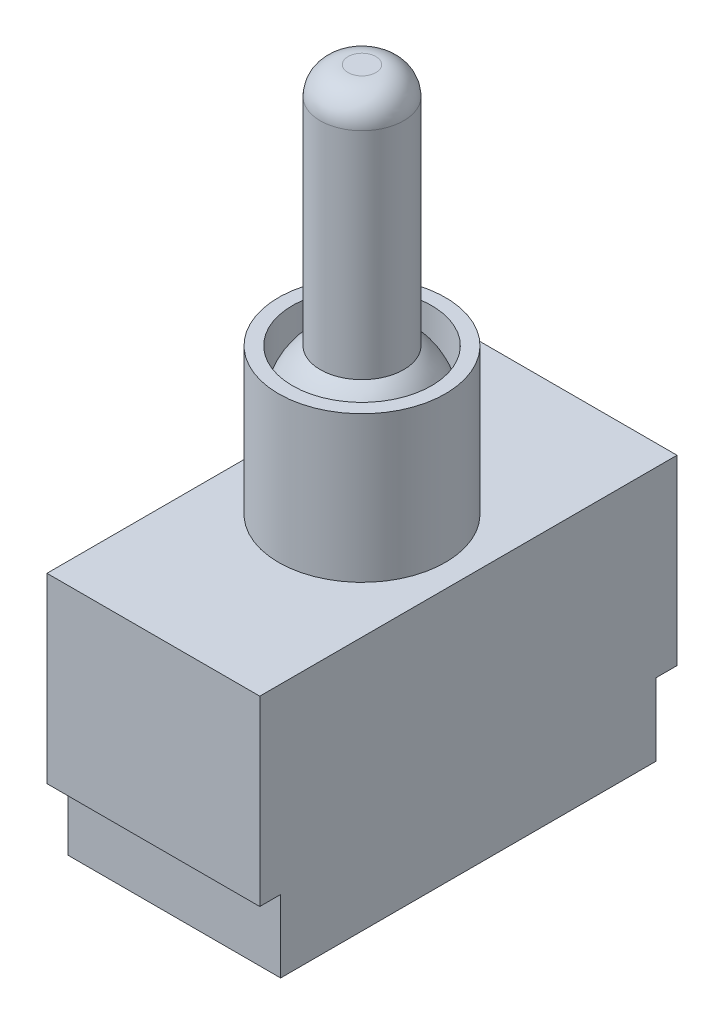
ISO-10303-21;
HEADER;
FILE_DESCRIPTION(('STEP AP214'),'2;1');
FILE_NAME('part.step','',(''),(''),'','','');
FILE_SCHEMA(('AUTOMOTIVE_DESIGN { 1 0 10303 214 1 1 1 1 }'));
ENDSEC;
DATA;
#1=APPLICATION_CONTEXT('core data for automotive mechanical design processes');
#2=APPLICATION_PROTOCOL_DEFINITION('international standard','automotive_design',2000,#1);
#3=PRODUCT_CONTEXT('',#1,'mechanical');
#4=PRODUCT('Part','Part','',(#3));
#5=PRODUCT_RELATED_PRODUCT_CATEGORY('part','',(#4));
#6=PRODUCT_DEFINITION_FORMATION('','',#4);
#7=PRODUCT_DEFINITION_CONTEXT('part definition',#1,'design');
#8=PRODUCT_DEFINITION('design','',#6,#7);
#9=PRODUCT_DEFINITION_SHAPE('','',#8);
#10=(LENGTH_UNIT() NAMED_UNIT(*) SI_UNIT(.MILLI.,.METRE.));
#11=(NAMED_UNIT(*) PLANE_ANGLE_UNIT() SI_UNIT($,.RADIAN.));
#12=(NAMED_UNIT(*) SI_UNIT($,.STERADIAN.) SOLID_ANGLE_UNIT());
#13=UNCERTAINTY_MEASURE_WITH_UNIT(LENGTH_MEASURE(1.E-05),#10,'distance_accuracy_value','');
#14=(GEOMETRIC_REPRESENTATION_CONTEXT(3) GLOBAL_UNCERTAINTY_ASSIGNED_CONTEXT((#13)) GLOBAL_UNIT_ASSIGNED_CONTEXT((#10,
#11,#12)) REPRESENTATION_CONTEXT('',''));
#15=CARTESIAN_POINT('',(0.,0.,0.));
#16=DIRECTION('',(0.,0.,1.));
#17=DIRECTION('',(1.,0.,0.));
#18=AXIS2_PLACEMENT_3D('',#15,#16,#17);
#19=CARTESIAN_POINT('',(0.,0.,0.));
#20=DIRECTION('',(0.,1.,0.));
#21=DIRECTION('',(0.,0.,1.));
#22=AXIS2_PLACEMENT_3D('',#19,#20,#21);
#23=PLANE('',#22);
#24=DIRECTION('',(-1.,0.,0.));
#25=VECTOR('',#24,1.);
#26=CARTESIAN_POINT('',(7.65,0.,13.5));
#27=LINE('',#26,#25);
#28=CARTESIAN_POINT('',(7.65,0.,13.5));
#29=VERTEX_POINT('',#28);
#30=CARTESIAN_POINT('',(-7.65,0.,13.5));
#31=VERTEX_POINT('',#30);
#32=EDGE_CURVE('E50',#29,#31,#27,.T.);
#33=ORIENTED_EDGE('',*,*,#32,.F.);
#34=DIRECTION('',(0.,0.,-1.));
#35=VECTOR('',#34,1.);
#36=CARTESIAN_POINT('',(7.65,0.,15.));
#37=LINE('',#36,#35);
#38=CARTESIAN_POINT('',(7.65,0.,15.));
#39=VERTEX_POINT('',#38);
#40=EDGE_CURVE('E157',#39,#29,#37,.T.);
#41=ORIENTED_EDGE('',*,*,#40,.F.);
#42=DIRECTION('',(1.,0.,0.));
#43=VECTOR('',#42,1.);
#44=CARTESIAN_POINT('',(7.65,0.,15.));
#45=LINE('',#44,#43);
#46=CARTESIAN_POINT('',(-7.65,0.,15.));
#47=VERTEX_POINT('',#46);
#48=EDGE_CURVE('E154',#47,#39,#45,.T.);
#49=ORIENTED_EDGE('',*,*,#48,.F.);
#50=DIRECTION('',(0.,0.,1.));
#51=VECTOR('',#50,1.);
#52=CARTESIAN_POINT('',(-7.65,0.,15.));
#53=LINE('',#52,#51);
#54=EDGE_CURVE('E55',#31,#47,#53,.T.);
#55=ORIENTED_EDGE('',*,*,#54,.F.);
#56=EDGE_LOOP('',(#33,#41,#49,#55));
#57=FACE_BOUND('',#56,.T.);
#58=ADVANCED_FACE('F35',(#57),#23,.F.);
#59=DIRECTION('',(1.,0.,0.));
#60=VECTOR('',#59,1.);
#61=CARTESIAN_POINT('',(7.65,0.,-13.5));
#62=LINE('',#61,#60);
#63=CARTESIAN_POINT('',(-7.65,0.,-13.5));
#64=VERTEX_POINT('',#63);
#65=CARTESIAN_POINT('',(7.65,0.,-13.5));
#66=VERTEX_POINT('',#65);
#67=EDGE_CURVE('E327',#64,#66,#62,.T.);
#68=ORIENTED_EDGE('',*,*,#67,.F.);
#69=CARTESIAN_POINT('',(-7.65,0.,-15.));
#70=VERTEX_POINT('',#69);
#71=EDGE_CURVE('E124',#70,#64,#53,.T.);
#72=ORIENTED_EDGE('',*,*,#71,.F.);
#73=DIRECTION('',(-1.,0.,0.));
#74=VECTOR('',#73,1.);
#75=CARTESIAN_POINT('',(7.65,0.,-15.));
#76=LINE('',#75,#74);
#77=CARTESIAN_POINT('',(7.65,0.,-15.));
#78=VERTEX_POINT('',#77);
#79=EDGE_CURVE('E146',#78,#70,#76,.T.);
#80=ORIENTED_EDGE('',*,*,#79,.F.);
#81=EDGE_CURVE('E156',#66,#78,#37,.T.);
#82=ORIENTED_EDGE('',*,*,#81,.F.);
#83=EDGE_LOOP('',(#68,#72,#80,#82));
#84=FACE_BOUND('',#83,.T.);
#85=ADVANCED_FACE('F190',(#84),#23,.F.);
#86=CARTESIAN_POINT('',(-7.65,13.1,15.));
#87=DIRECTION('',(1.,0.,0.));
#88=DIRECTION('',(0.,0.,-1.));
#89=AXIS2_PLACEMENT_3D('',#86,#87,#88);
#90=PLANE('',#89);
#91=ORIENTED_EDGE('',*,*,#71,.T.);
#92=DIRECTION('',(0.,1.,0.));
#93=VECTOR('',#92,1.);
#94=CARTESIAN_POINT('',(-7.65,-5.2,-13.5));
#95=LINE('',#94,#93);
#96=CARTESIAN_POINT('',(-7.65,-5.2,-13.5));
#97=VERTEX_POINT('',#96);
#98=EDGE_CURVE('E104',#97,#64,#95,.T.);
#99=ORIENTED_EDGE('',*,*,#98,.F.);
#100=DIRECTION('',(0.,0.,-1.));
#101=VECTOR('',#100,1.);
#102=CARTESIAN_POINT('',(-7.65,-5.2,13.5));
#103=LINE('',#102,#101);
#104=CARTESIAN_POINT('',(-7.65,-5.2,13.5));
#105=VERTEX_POINT('',#104);
#106=EDGE_CURVE('E110',#105,#97,#103,.T.);
#107=ORIENTED_EDGE('',*,*,#106,.F.);
#108=DIRECTION('',(0.,1.,0.));
#109=VECTOR('',#108,1.);
#110=CARTESIAN_POINT('',(-7.65,-5.2,13.5));
#111=LINE('',#110,#109);
#112=EDGE_CURVE('E325',#105,#31,#111,.T.);
#113=ORIENTED_EDGE('',*,*,#112,.T.);
#114=ORIENTED_EDGE('',*,*,#54,.T.);
#115=DIRECTION('',(0.,-1.,0.));
#116=VECTOR('',#115,1.);
#117=CARTESIAN_POINT('',(-7.65,13.1,15.));
#118=LINE('',#117,#116);
#119=CARTESIAN_POINT('',(-7.65,13.1,15.));
#120=VERTEX_POINT('',#119);
#121=EDGE_CURVE('E167',#120,#47,#118,.T.);
#122=ORIENTED_EDGE('',*,*,#121,.F.);
#123=DIRECTION('',(0.,0.,1.));
#124=VECTOR('',#123,1.);
#125=CARTESIAN_POINT('',(-7.65,13.1,15.));
#126=LINE('',#125,#124);
#127=CARTESIAN_POINT('',(-7.65,13.1,-15.));
#128=VERTEX_POINT('',#127);
#129=EDGE_CURVE('E142',#128,#120,#126,.T.);
#130=ORIENTED_EDGE('',*,*,#129,.F.);
#131=DIRECTION('',(0.,-1.,0.));
#132=VECTOR('',#131,1.);
#133=CARTESIAN_POINT('',(-7.65,13.1,-15.));
#134=LINE('',#133,#132);
#135=EDGE_CURVE('E152',#128,#70,#134,.T.);
#136=ORIENTED_EDGE('',*,*,#135,.T.);
#137=EDGE_LOOP('',(#91,#99,#107,#113,#114,#122,#130,#136));
#138=FACE_BOUND('',#137,.T.);
#139=ADVANCED_FACE('F121',(#138),#90,.F.);
#140=CARTESIAN_POINT('',(7.65,13.1,15.));
#141=DIRECTION('',(0.,0.,-1.));
#142=DIRECTION('',(-1.,0.,0.));
#143=AXIS2_PLACEMENT_3D('',#140,#141,#142);
#144=PLANE('',#143);
#145=ORIENTED_EDGE('',*,*,#48,.T.);
#146=DIRECTION('',(0.,-1.,0.));
#147=VECTOR('',#146,1.);
#148=CARTESIAN_POINT('',(7.65,13.1,15.));
#149=LINE('',#148,#147);
#150=CARTESIAN_POINT('',(7.65,13.1,15.));
#151=VERTEX_POINT('',#150);
#152=EDGE_CURVE('E164',#151,#39,#149,.T.);
#153=ORIENTED_EDGE('',*,*,#152,.F.);
#154=DIRECTION('',(1.,0.,0.));
#155=VECTOR('',#154,1.);
#156=CARTESIAN_POINT('',(7.65,13.1,15.));
#157=LINE('',#156,#155);
#158=EDGE_CURVE('E145',#120,#151,#157,.T.);
#159=ORIENTED_EDGE('',*,*,#158,.F.);
#160=ORIENTED_EDGE('',*,*,#121,.T.);
#161=EDGE_LOOP('',(#145,#153,#159,#160));
#162=FACE_BOUND('',#161,.T.);
#163=ADVANCED_FACE('F207',(#162),#144,.F.);
#164=CARTESIAN_POINT('',(7.65,13.1,15.));
#165=DIRECTION('',(-1.,0.,0.));
#166=DIRECTION('',(0.,0.,1.));
#167=AXIS2_PLACEMENT_3D('',#164,#165,#166);
#168=PLANE('',#167);
#169=ORIENTED_EDGE('',*,*,#40,.T.);
#170=DIRECTION('',(0.,1.,0.));
#171=VECTOR('',#170,1.);
#172=CARTESIAN_POINT('',(7.65,-5.2,13.5));
#173=LINE('',#172,#171);
#174=CARTESIAN_POINT('',(7.65,-5.2,13.5));
#175=VERTEX_POINT('',#174);
#176=EDGE_CURVE('E130',#175,#29,#173,.T.);
#177=ORIENTED_EDGE('',*,*,#176,.F.);
#178=DIRECTION('',(0.,0.,1.));
#179=VECTOR('',#178,1.);
#180=CARTESIAN_POINT('',(7.65,-5.2,13.5));
#181=LINE('',#180,#179);
#182=CARTESIAN_POINT('',(7.65,-5.2,-13.5));
#183=VERTEX_POINT('',#182);
#184=EDGE_CURVE('E109',#183,#175,#181,.T.);
#185=ORIENTED_EDGE('',*,*,#184,.F.);
#186=DIRECTION('',(0.,1.,0.));
#187=VECTOR('',#186,1.);
#188=CARTESIAN_POINT('',(7.65,-5.2,-13.5));
#189=LINE('',#188,#187);
#190=EDGE_CURVE('E106',#183,#66,#189,.T.);
#191=ORIENTED_EDGE('',*,*,#190,.T.);
#192=ORIENTED_EDGE('',*,*,#81,.T.);
#193=DIRECTION('',(0.,-1.,0.));
#194=VECTOR('',#193,1.);
#195=CARTESIAN_POINT('',(7.65,13.1,-15.));
#196=LINE('',#195,#194);
#197=CARTESIAN_POINT('',(7.65,13.1,-15.));
#198=VERTEX_POINT('',#197);
#199=EDGE_CURVE('E161',#198,#78,#196,.T.);
#200=ORIENTED_EDGE('',*,*,#199,.F.);
#201=DIRECTION('',(0.,0.,-1.));
#202=VECTOR('',#201,1.);
#203=CARTESIAN_POINT('',(7.65,13.1,15.));
#204=LINE('',#203,#202);
#205=EDGE_CURVE('E148',#151,#198,#204,.T.);
#206=ORIENTED_EDGE('',*,*,#205,.F.);
#207=ORIENTED_EDGE('',*,*,#152,.T.);
#208=EDGE_LOOP('',(#169,#177,#185,#191,#192,#200,#206,#207));
#209=FACE_BOUND('',#208,.T.);
#210=ADVANCED_FACE('F203',(#209),#168,.F.);
#211=CARTESIAN_POINT('',(7.65,13.1,-15.));
#212=DIRECTION('',(0.,0.,1.));
#213=DIRECTION('',(1.,0.,0.));
#214=AXIS2_PLACEMENT_3D('',#211,#212,#213);
#215=PLANE('',#214);
#216=ORIENTED_EDGE('',*,*,#79,.T.);
#217=ORIENTED_EDGE('',*,*,#135,.F.);
#218=DIRECTION('',(-1.,0.,0.));
#219=VECTOR('',#218,1.);
#220=CARTESIAN_POINT('',(7.65,13.1,-15.));
#221=LINE('',#220,#219);
#222=EDGE_CURVE('E150',#198,#128,#221,.T.);
#223=ORIENTED_EDGE('',*,*,#222,.F.);
#224=ORIENTED_EDGE('',*,*,#199,.T.);
#225=EDGE_LOOP('',(#216,#217,#223,#224));
#226=FACE_BOUND('',#225,.T.);
#227=ADVANCED_FACE('F200',(#226),#215,.F.);
#228=CARTESIAN_POINT('',(0.,13.1,0.));
#229=DIRECTION('',(0.,1.,0.));
#230=DIRECTION('',(0.,0.,1.));
#231=AXIS2_PLACEMENT_3D('',#228,#229,#230);
#232=PLANE('',#231);
#233=CARTESIAN_POINT('',(0.,13.1,0.));
#234=DIRECTION('',(0.,1.,0.));
#235=DIRECTION('',(0.,0.,1.));
#236=AXIS2_PLACEMENT_3D('',#233,#234,#235);
#237=CIRCLE('',#236,6.);
#238=CARTESIAN_POINT('',(0.,13.1,6.));
#239=VERTEX_POINT('',#238);
#240=EDGE_CURVE('E135',#239,#239,#237,.T.);
#241=ORIENTED_EDGE('',*,*,#240,.F.);
#242=EDGE_LOOP('',(#241));
#243=FACE_BOUND('',#242,.T.);
#244=ORIENTED_EDGE('',*,*,#129,.T.);
#245=ORIENTED_EDGE('',*,*,#158,.T.);
#246=ORIENTED_EDGE('',*,*,#205,.T.);
#247=ORIENTED_EDGE('',*,*,#222,.T.);
#248=EDGE_LOOP('',(#244,#245,#246,#247));
#249=FACE_BOUND('',#248,.T.);
#250=ADVANCED_FACE('F198',(#243,#249),#232,.T.);
#251=CARTESIAN_POINT('',(0.,23.6,0.));
#252=DIRECTION('',(0.,-1.,0.));
#253=DIRECTION('',(0.,0.,-1.));
#254=AXIS2_PLACEMENT_3D('',#251,#252,#253);
#255=CYLINDRICAL_SURFACE('',#254,6.);
#256=CARTESIAN_POINT('',(0.,23.6,0.));
#257=DIRECTION('',(0.,1.,0.));
#258=DIRECTION('',(0.,0.,1.));
#259=AXIS2_PLACEMENT_3D('',#256,#257,#258);
#260=CIRCLE('',#259,6.);
#261=CARTESIAN_POINT('',(0.,23.6,6.));
#262=VERTEX_POINT('',#261);
#263=EDGE_CURVE('E137',#262,#262,#260,.T.);
#264=ORIENTED_EDGE('',*,*,#263,.F.);
#265=EDGE_LOOP('',(#264));
#266=FACE_BOUND('',#265,.T.);
#267=ORIENTED_EDGE('',*,*,#240,.T.);
#268=EDGE_LOOP('',(#267));
#269=FACE_BOUND('',#268,.T.);
#270=ADVANCED_FACE('F235',(#266,#269),#255,.T.);
#271=CARTESIAN_POINT('',(0.,23.6,0.));
#272=DIRECTION('',(0.,1.,0.));
#273=DIRECTION('',(0.,0.,1.));
#274=AXIS2_PLACEMENT_3D('',#271,#272,#273);
#275=PLANE('',#274);
#276=CARTESIAN_POINT('',(0.,23.6,0.));
#277=DIRECTION('',(0.,1.,0.));
#278=DIRECTION('',(0.,0.,1.));
#279=AXIS2_PLACEMENT_3D('',#276,#277,#278);
#280=CIRCLE('',#279,5.);
#281=CARTESIAN_POINT('',(0.,23.6,5.));
#282=VERTEX_POINT('',#281);
#283=EDGE_CURVE('E125',#282,#282,#280,.T.);
#284=ORIENTED_EDGE('',*,*,#283,.F.);
#285=EDGE_LOOP('',(#284));
#286=FACE_BOUND('',#285,.T.);
#287=ORIENTED_EDGE('',*,*,#263,.T.);
#288=EDGE_LOOP('',(#287));
#289=FACE_BOUND('',#288,.T.);
#290=ADVANCED_FACE('F242',(#286,#289),#275,.T.);
#291=CARTESIAN_POINT('',(0.,19.6,0.));
#292=DIRECTION('',(0.,1.,0.));
#293=DIRECTION('',(0.,0.,1.));
#294=AXIS2_PLACEMENT_3D('',#291,#292,#293);
#295=CYLINDRICAL_SURFACE('',#294,5.);
#296=CARTESIAN_POINT('',(0.,19.6,0.));
#297=DIRECTION('',(0.,1.,0.));
#298=DIRECTION('',(0.,0.,1.));
#299=AXIS2_PLACEMENT_3D('',#296,#297,#298);
#300=CIRCLE('',#299,5.);
#301=CARTESIAN_POINT('',(0.,19.6,5.));
#302=VERTEX_POINT('',#301);
#303=EDGE_CURVE('E128',#302,#302,#300,.T.);
#304=ORIENTED_EDGE('',*,*,#303,.F.);
#305=EDGE_LOOP('',(#304));
#306=FACE_BOUND('',#305,.T.);
#307=ORIENTED_EDGE('',*,*,#283,.T.);
#308=EDGE_LOOP('',(#307));
#309=FACE_BOUND('',#308,.T.);
#310=ADVANCED_FACE('F249',(#306,#309),#295,.F.);
#311=CARTESIAN_POINT('',(0.,19.6,0.));
#312=DIRECTION('',(0.,0.,1.));
#313=DIRECTION('',(1.,0.,0.));
#314=AXIS2_PLACEMENT_3D('',#311,#312,#313);
#315=SPHERICAL_SURFACE('',#314,5.);
#316=CARTESIAN_POINT('',(0.,19.6,0.));
#317=DIRECTION('',(0.,1.,0.));
#318=DIRECTION('',(0.,0.,1.));
#319=AXIS2_PLACEMENT_3D('',#316,#317,#318);
#320=SPHERICAL_SURFACE('',#319,5.);
#321=ORIENTED_EDGE('',*,*,#303,.T.);
#322=EDGE_LOOP('',(#321));
#323=FACE_BOUND('',#322,.T.);
#324=CARTESIAN_POINT('',(0.,23.6,0.));
#325=DIRECTION('',(0.,-1.,0.));
#326=DIRECTION('',(0.,0.,-1.));
#327=AXIS2_PLACEMENT_3D('',#324,#325,#326);
#328=CIRCLE('',#327,3.);
#329=CARTESIAN_POINT('',(0.,23.6,-3.));
#330=VERTEX_POINT('',#329);
#331=EDGE_CURVE('E170',#330,#330,#328,.T.);
#332=ORIENTED_EDGE('',*,*,#331,.T.);
#333=EDGE_LOOP('',(#332));
#334=FACE_BOUND('',#333,.T.);
#335=ADVANCED_FACE('F257',(#323,#334),#320,.T.);
#336=CARTESIAN_POINT('',(0.,41.1,0.));
#337=DIRECTION('',(0.,1.,0.));
#338=DIRECTION('',(0.,0.,1.));
#339=AXIS2_PLACEMENT_3D('',#336,#337,#338);
#340=PLANE('',#339);
#341=CARTESIAN_POINT('',(0.,41.1,0.));
#342=DIRECTION('',(0.,1.,0.));
#343=DIRECTION('',(0.,0.,1.));
#344=AXIS2_PLACEMENT_3D('',#341,#342,#343);
#345=CIRCLE('',#344,1.);
#346=CARTESIAN_POINT('',(0.,41.1,1.));
#347=VERTEX_POINT('',#346);
#348=EDGE_CURVE('E43',#347,#347,#345,.T.);
#349=ORIENTED_EDGE('',*,*,#348,.T.);
#350=EDGE_LOOP('',(#349));
#351=FACE_BOUND('',#350,.T.);
#352=ADVANCED_FACE('F175',(#351),#340,.T.);
#353=CARTESIAN_POINT('',(0.,41.1,0.));
#354=DIRECTION('',(0.,-1.,0.));
#355=DIRECTION('',(0.,0.,-1.));
#356=AXIS2_PLACEMENT_3D('',#353,#354,#355);
#357=CYLINDRICAL_SURFACE('',#356,3.);
#358=CARTESIAN_POINT('',(0.,39.1,0.));
#359=DIRECTION('',(0.,1.,0.));
#360=DIRECTION('',(0.,0.,1.));
#361=AXIS2_PLACEMENT_3D('',#358,#359,#360);
#362=CIRCLE('',#361,3.);
#363=CARTESIAN_POINT('',(0.,39.1,3.));
#364=VERTEX_POINT('',#363);
#365=EDGE_CURVE('E11',#364,#364,#362,.F.);
#366=ORIENTED_EDGE('',*,*,#365,.T.);
#367=EDGE_LOOP('',(#366));
#368=FACE_BOUND('',#367,.T.);
#369=ORIENTED_EDGE('',*,*,#331,.F.);
#370=EDGE_LOOP('',(#369));
#371=FACE_BOUND('',#370,.T.);
#372=ADVANCED_FACE('F178',(#368,#371),#357,.T.);
#373=CARTESIAN_POINT('',(0.,39.1,0.));
#374=DIRECTION('',(0.,1.,0.));
#375=DIRECTION('',(0.,0.,1.));
#376=AXIS2_PLACEMENT_3D('',#373,#374,#375);
#377=DEGENERATE_TOROIDAL_SURFACE('',#376,1.,2.,.T.);
#378=ORIENTED_EDGE('',*,*,#365,.F.);
#379=EDGE_LOOP('',(#378));
#380=FACE_BOUND('',#379,.T.);
#381=ORIENTED_EDGE('',*,*,#348,.F.);
#382=EDGE_LOOP('',(#381));
#383=FACE_BOUND('',#382,.T.);
#384=ADVANCED_FACE('F37',(#380,#383),#377,.T.);
#385=CARTESIAN_POINT('',(7.65,-5.2,-13.5));
#386=DIRECTION('',(0.,0.,1.));
#387=DIRECTION('',(1.,0.,0.));
#388=AXIS2_PLACEMENT_3D('',#385,#386,#387);
#389=PLANE('',#388);
#390=ORIENTED_EDGE('',*,*,#67,.T.);
#391=ORIENTED_EDGE('',*,*,#190,.F.);
#392=DIRECTION('',(1.,0.,0.));
#393=VECTOR('',#392,1.);
#394=CARTESIAN_POINT('',(7.65,-5.2,-13.5));
#395=LINE('',#394,#393);
#396=EDGE_CURVE('E99',#97,#183,#395,.T.);
#397=ORIENTED_EDGE('',*,*,#396,.F.);
#398=ORIENTED_EDGE('',*,*,#98,.T.);
#399=EDGE_LOOP('',(#390,#391,#397,#398));
#400=FACE_BOUND('',#399,.T.);
#401=ADVANCED_FACE('F102',(#400),#389,.F.);
#402=CARTESIAN_POINT('',(7.65,-5.2,13.5));
#403=DIRECTION('',(0.,0.,-1.));
#404=DIRECTION('',(-1.,0.,0.));
#405=AXIS2_PLACEMENT_3D('',#402,#403,#404);
#406=PLANE('',#405);
#407=ORIENTED_EDGE('',*,*,#32,.T.);
#408=ORIENTED_EDGE('',*,*,#112,.F.);
#409=DIRECTION('',(-1.,0.,0.));
#410=VECTOR('',#409,1.);
#411=CARTESIAN_POINT('',(7.65,-5.2,13.5));
#412=LINE('',#411,#410);
#413=EDGE_CURVE('E115',#175,#105,#412,.T.);
#414=ORIENTED_EDGE('',*,*,#413,.F.);
#415=ORIENTED_EDGE('',*,*,#176,.T.);
#416=EDGE_LOOP('',(#407,#408,#414,#415));
#417=FACE_BOUND('',#416,.T.);
#418=ADVANCED_FACE('F184',(#417),#406,.F.);
#419=CARTESIAN_POINT('',(0.,-5.2,0.));
#420=DIRECTION('',(0.,1.,0.));
#421=DIRECTION('',(0.,0.,1.));
#422=AXIS2_PLACEMENT_3D('',#419,#420,#421);
#423=PLANE('',#422);
#424=ORIENTED_EDGE('',*,*,#106,.T.);
#425=ORIENTED_EDGE('',*,*,#396,.T.);
#426=ORIENTED_EDGE('',*,*,#184,.T.);
#427=ORIENTED_EDGE('',*,*,#413,.T.);
#428=EDGE_LOOP('',(#424,#425,#426,#427));
#429=FACE_BOUND('',#428,.T.);
#430=ADVANCED_FACE('F113',(#429),#423,.F.);
#431=CLOSED_SHELL('',(#58,#85,#139,#163,#210,#227,#250,#270,#290,#310,#335,#352,#372,#384,#401,
#418,#430));
#432=MANIFOLD_SOLID_BREP('B2',#431);
#433=ADVANCED_BREP_SHAPE_REPRESENTATION('',(#18,#432),#14);
#434=SHAPE_DEFINITION_REPRESENTATION(#9,#433);
ENDSEC;
END-ISO-10303-21;
